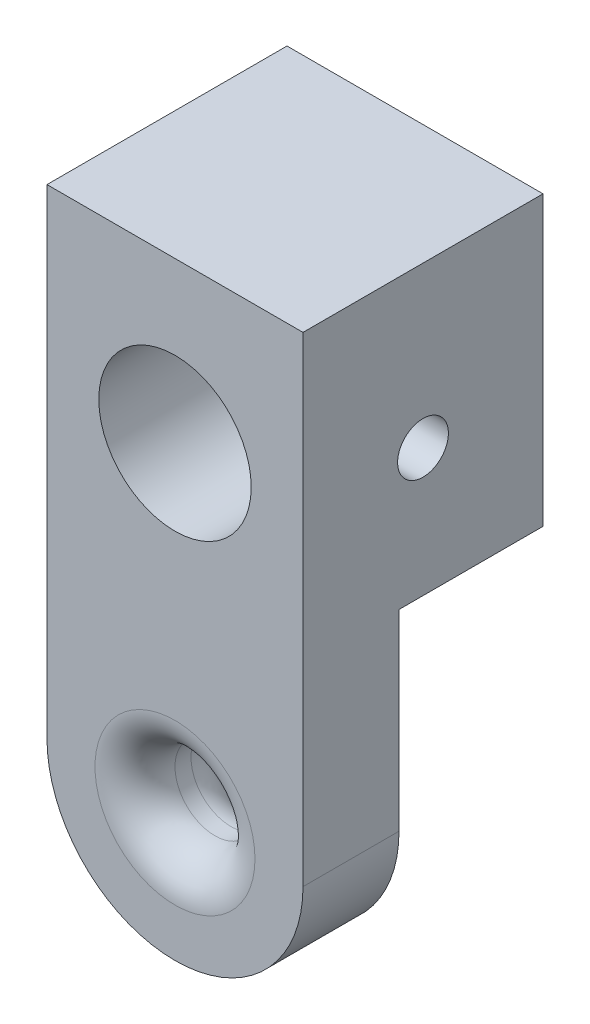
ISO-10303-21;
HEADER;
FILE_DESCRIPTION(('STEP AP214'),'2;1');
FILE_NAME('part.step','',(''),(''),'','','');
FILE_SCHEMA(('AUTOMOTIVE_DESIGN { 1 0 10303 214 1 1 1 1 }'));
ENDSEC;
DATA;
#1=APPLICATION_CONTEXT('core data for automotive mechanical design processes');
#2=APPLICATION_PROTOCOL_DEFINITION('international standard','automotive_design',2000,#1);
#3=PRODUCT_CONTEXT('',#1,'mechanical');
#4=PRODUCT('Part','Part','',(#3));
#5=PRODUCT_RELATED_PRODUCT_CATEGORY('part','',(#4));
#6=PRODUCT_DEFINITION_FORMATION('','',#4);
#7=PRODUCT_DEFINITION_CONTEXT('part definition',#1,'design');
#8=PRODUCT_DEFINITION('design','',#6,#7);
#9=PRODUCT_DEFINITION_SHAPE('','',#8);
#10=(LENGTH_UNIT() NAMED_UNIT(*) SI_UNIT(.MILLI.,.METRE.));
#11=(NAMED_UNIT(*) PLANE_ANGLE_UNIT() SI_UNIT($,.RADIAN.));
#12=(NAMED_UNIT(*) SI_UNIT($,.STERADIAN.) SOLID_ANGLE_UNIT());
#13=UNCERTAINTY_MEASURE_WITH_UNIT(LENGTH_MEASURE(1.E-05),#10,'distance_accuracy_value','');
#14=(GEOMETRIC_REPRESENTATION_CONTEXT(3) GLOBAL_UNCERTAINTY_ASSIGNED_CONTEXT((#13)) GLOBAL_UNIT_ASSIGNED_CONTEXT((#10,
#11,#12)) REPRESENTATION_CONTEXT('',''));
#15=CARTESIAN_POINT('',(0.,0.,0.));
#16=DIRECTION('',(0.,0.,1.));
#17=DIRECTION('',(1.,0.,0.));
#18=AXIS2_PLACEMENT_3D('',#15,#16,#17);
#19=CARTESIAN_POINT('',(0.,0.,0.));
#20=DIRECTION('',(0.,0.,1.));
#21=DIRECTION('',(1.,0.,0.));
#22=AXIS2_PLACEMENT_3D('',#19,#20,#21);
#23=PLANE('',#22);
#24=CARTESIAN_POINT('',(0.,20.,0.));
#25=DIRECTION('',(0.,0.,1.));
#26=DIRECTION('',(1.,0.,0.));
#27=AXIS2_PLACEMENT_3D('',#24,#25,#26);
#28=CIRCLE('',#27,4.7625);
#29=CARTESIAN_POINT('',(4.7625,20.,0.));
#30=VERTEX_POINT('',#29);
#31=EDGE_CURVE('E121',#30,#30,#28,.T.);
#32=ORIENTED_EDGE('',*,*,#31,.T.);
#33=EDGE_LOOP('',(#32));
#34=FACE_BOUND('',#33,.T.);
#35=DIRECTION('',(-1.,0.,0.));
#36=VECTOR('',#35,1.);
#37=CARTESIAN_POINT('',(8.,12.,0.));
#38=LINE('',#37,#36);
#39=CARTESIAN_POINT('',(8.,12.,0.));
#40=VERTEX_POINT('',#39);
#41=CARTESIAN_POINT('',(-8.,12.,0.));
#42=VERTEX_POINT('',#41);
#43=EDGE_CURVE('E113',#40,#42,#38,.T.);
#44=ORIENTED_EDGE('',*,*,#43,.T.);
#45=DIRECTION('',(0.,-1.,0.));
#46=VECTOR('',#45,1.);
#47=CARTESIAN_POINT('',(-8.,12.,0.));
#48=LINE('',#47,#46);
#49=CARTESIAN_POINT('',(-8.,30.,0.));
#50=VERTEX_POINT('',#49);
#51=EDGE_CURVE('E79',#50,#42,#48,.T.);
#52=ORIENTED_EDGE('',*,*,#51,.F.);
#53=DIRECTION('',(-1.,0.,0.));
#54=VECTOR('',#53,1.);
#55=CARTESIAN_POINT('',(8.,30.,0.));
#56=LINE('',#55,#54);
#57=CARTESIAN_POINT('',(8.,30.,0.));
#58=VERTEX_POINT('',#57);
#59=EDGE_CURVE('E138',#58,#50,#56,.T.);
#60=ORIENTED_EDGE('',*,*,#59,.F.);
#61=DIRECTION('',(0.,1.,0.));
#62=VECTOR('',#61,1.);
#63=CARTESIAN_POINT('',(8.,12.,0.));
#64=LINE('',#63,#62);
#65=EDGE_CURVE('E129',#40,#58,#64,.T.);
#66=ORIENTED_EDGE('',*,*,#65,.F.);
#67=EDGE_LOOP('',(#44,#52,#60,#66));
#68=FACE_BOUND('',#67,.T.);
#69=ADVANCED_FACE('F32',(#34,#68),#23,.F.);
#70=CARTESIAN_POINT('',(0.,0.,15.));
#71=DIRECTION('',(0.,0.,-1.));
#72=DIRECTION('',(-1.,0.,0.));
#73=AXIS2_PLACEMENT_3D('',#70,#71,#72);
#74=CYLINDRICAL_SURFACE('',#73,8.);
#75=CARTESIAN_POINT('',(0.,0.,9.));
#76=DIRECTION('',(0.,0.,-1.));
#77=DIRECTION('',(-1.,0.,0.));
#78=AXIS2_PLACEMENT_3D('',#75,#76,#77);
#79=CIRCLE('',#78,8.);
#80=CARTESIAN_POINT('',(8.,0.,9.));
#81=VERTEX_POINT('',#80);
#82=CARTESIAN_POINT('',(-8.,0.,9.));
#83=VERTEX_POINT('',#82);
#84=EDGE_CURVE('E54',#81,#83,#79,.T.);
#85=ORIENTED_EDGE('',*,*,#84,.F.);
#86=DIRECTION('',(0.,0.,-1.));
#87=VECTOR('',#86,1.);
#88=CARTESIAN_POINT('',(8.,0.,15.));
#89=LINE('',#88,#87);
#90=CARTESIAN_POINT('',(8.,0.,15.));
#91=VERTEX_POINT('',#90);
#92=EDGE_CURVE('E119',#91,#81,#89,.T.);
#93=ORIENTED_EDGE('',*,*,#92,.F.);
#94=CARTESIAN_POINT('',(0.,0.,15.));
#95=DIRECTION('',(0.,0.,1.));
#96=DIRECTION('',(1.,0.,0.));
#97=AXIS2_PLACEMENT_3D('',#94,#95,#96);
#98=CIRCLE('',#97,8.);
#99=CARTESIAN_POINT('',(-8.,0.,15.));
#100=VERTEX_POINT('',#99);
#101=EDGE_CURVE('E130',#100,#91,#98,.T.);
#102=ORIENTED_EDGE('',*,*,#101,.F.);
#103=DIRECTION('',(0.,0.,-1.));
#104=VECTOR('',#103,1.);
#105=CARTESIAN_POINT('',(-8.,0.,15.));
#106=LINE('',#105,#104);
#107=EDGE_CURVE('E136',#100,#83,#106,.T.);
#108=ORIENTED_EDGE('',*,*,#107,.T.);
#109=EDGE_LOOP('',(#85,#93,#102,#108));
#110=FACE_BOUND('',#109,.T.);
#111=ADVANCED_FACE('F179',(#110),#74,.T.);
#112=CARTESIAN_POINT('',(8.,12.,15.));
#113=DIRECTION('',(-1.,0.,0.));
#114=DIRECTION('',(0.,-1.,0.));
#115=AXIS2_PLACEMENT_3D('',#112,#113,#114);
#116=PLANE('',#115);
#117=CARTESIAN_POINT('',(8.00000000000001,20.,7.5));
#118=DIRECTION('',(-1.,0.,0.));
#119=DIRECTION('',(0.,0.,1.));
#120=AXIS2_PLACEMENT_3D('',#117,#118,#119);
#121=CIRCLE('',#120,1.5875);
#122=CARTESIAN_POINT('',(8.00000000000001,20.,9.0875));
#123=VERTEX_POINT('',#122);
#124=EDGE_CURVE('E162',#123,#123,#121,.T.);
#125=ORIENTED_EDGE('',*,*,#124,.T.);
#126=EDGE_LOOP('',(#125));
#127=FACE_BOUND('',#126,.T.);
#128=DIRECTION('',(0.,0.,-1.));
#129=VECTOR('',#128,1.);
#130=CARTESIAN_POINT('',(8.,12.,9.));
#131=LINE('',#130,#129);
#132=CARTESIAN_POINT('',(8.,12.,9.));
#133=VERTEX_POINT('',#132);
#134=EDGE_CURVE('E111',#133,#40,#131,.T.);
#135=ORIENTED_EDGE('',*,*,#134,.T.);
#136=ORIENTED_EDGE('',*,*,#65,.T.);
#137=DIRECTION('',(0.,0.,-1.));
#138=VECTOR('',#137,1.);
#139=CARTESIAN_POINT('',(8.,30.,15.));
#140=LINE('',#139,#138);
#141=CARTESIAN_POINT('',(8.,30.,15.));
#142=VERTEX_POINT('',#141);
#143=EDGE_CURVE('E146',#142,#58,#140,.T.);
#144=ORIENTED_EDGE('',*,*,#143,.F.);
#145=DIRECTION('',(0.,1.,0.));
#146=VECTOR('',#145,1.);
#147=CARTESIAN_POINT('',(8.,12.,15.));
#148=LINE('',#147,#146);
#149=EDGE_CURVE('E87',#91,#142,#148,.T.);
#150=ORIENTED_EDGE('',*,*,#149,.F.);
#151=ORIENTED_EDGE('',*,*,#92,.T.);
#152=DIRECTION('',(0.,1.,0.));
#153=VECTOR('',#152,1.);
#154=CARTESIAN_POINT('',(8.,12.,9.));
#155=LINE('',#154,#153);
#156=EDGE_CURVE('E105',#81,#133,#155,.T.);
#157=ORIENTED_EDGE('',*,*,#156,.T.);
#158=EDGE_LOOP('',(#135,#136,#144,#150,#151,#157));
#159=FACE_BOUND('',#158,.T.);
#160=ADVANCED_FACE('F117',(#127,#159),#116,.F.);
#161=CARTESIAN_POINT('',(-8.,12.,15.));
#162=DIRECTION('',(1.,0.,0.));
#163=DIRECTION('',(0.,1.,0.));
#164=AXIS2_PLACEMENT_3D('',#161,#162,#163);
#165=PLANE('',#164);
#166=CARTESIAN_POINT('',(-7.99999999999999,20.,7.5));
#167=DIRECTION('',(-1.,0.,0.));
#168=DIRECTION('',(0.,0.,1.));
#169=AXIS2_PLACEMENT_3D('',#166,#167,#168);
#170=CIRCLE('',#169,1.5875);
#171=CARTESIAN_POINT('',(-7.99999999999999,20.,9.0875));
#172=VERTEX_POINT('',#171);
#173=EDGE_CURVE('E320',#172,#172,#170,.T.);
#174=ORIENTED_EDGE('',*,*,#173,.F.);
#175=EDGE_LOOP('',(#174));
#176=FACE_BOUND('',#175,.T.);
#177=DIRECTION('',(0.,0.,-1.));
#178=VECTOR('',#177,1.);
#179=CARTESIAN_POINT('',(-8.,12.,9.));
#180=LINE('',#179,#178);
#181=CARTESIAN_POINT('',(-8.,12.,9.));
#182=VERTEX_POINT('',#181);
#183=EDGE_CURVE('E115',#182,#42,#180,.T.);
#184=ORIENTED_EDGE('',*,*,#183,.F.);
#185=DIRECTION('',(0.,-1.,0.));
#186=VECTOR('',#185,1.);
#187=CARTESIAN_POINT('',(-8.,12.,9.));
#188=LINE('',#187,#186);
#189=EDGE_CURVE('E106',#182,#83,#188,.T.);
#190=ORIENTED_EDGE('',*,*,#189,.T.);
#191=ORIENTED_EDGE('',*,*,#107,.F.);
#192=DIRECTION('',(0.,-1.,0.));
#193=VECTOR('',#192,1.);
#194=CARTESIAN_POINT('',(-8.,30.,15.));
#195=LINE('',#194,#193);
#196=CARTESIAN_POINT('',(-8.,30.,15.));
#197=VERTEX_POINT('',#196);
#198=EDGE_CURVE('E63',#197,#100,#195,.T.);
#199=ORIENTED_EDGE('',*,*,#198,.F.);
#200=DIRECTION('',(0.,0.,-1.));
#201=VECTOR('',#200,1.);
#202=CARTESIAN_POINT('',(-8.,30.,15.));
#203=LINE('',#202,#201);
#204=EDGE_CURVE('E143',#197,#50,#203,.T.);
#205=ORIENTED_EDGE('',*,*,#204,.T.);
#206=ORIENTED_EDGE('',*,*,#51,.T.);
#207=EDGE_LOOP('',(#184,#190,#191,#199,#205,#206));
#208=FACE_BOUND('',#207,.T.);
#209=ADVANCED_FACE('F192',(#176,#208),#165,.F.);
#210=CARTESIAN_POINT('',(0.,0.,15.));
#211=DIRECTION('',(0.,0.,-1.));
#212=DIRECTION('',(-1.,0.,0.));
#213=AXIS2_PLACEMENT_3D('',#210,#211,#212);
#214=CYLINDRICAL_SURFACE('',#213,2.5);
#215=CARTESIAN_POINT('',(0.,0.,12.5));
#216=DIRECTION('',(0.,0.,1.));
#217=DIRECTION('',(1.,0.,0.));
#218=AXIS2_PLACEMENT_3D('',#215,#216,#217);
#219=CIRCLE('',#218,2.5);
#220=CARTESIAN_POINT('',(2.5,0.,12.5));
#221=VERTEX_POINT('',#220);
#222=EDGE_CURVE('E153',#221,#221,#219,.T.);
#223=ORIENTED_EDGE('',*,*,#222,.T.);
#224=EDGE_LOOP('',(#223));
#225=FACE_BOUND('',#224,.T.);
#226=CARTESIAN_POINT('',(0.,0.,11.5));
#227=DIRECTION('',(0.,0.,-1.));
#228=DIRECTION('',(-1.,0.,0.));
#229=AXIS2_PLACEMENT_3D('',#226,#227,#228);
#230=CIRCLE('',#229,2.5);
#231=CARTESIAN_POINT('',(-2.5,0.,11.5));
#232=VERTEX_POINT('',#231);
#233=EDGE_CURVE('E150',#232,#232,#230,.T.);
#234=ORIENTED_EDGE('',*,*,#233,.T.);
#235=EDGE_LOOP('',(#234));
#236=FACE_BOUND('',#235,.T.);
#237=ADVANCED_FACE('F195',(#225,#236),#214,.F.);
#238=CARTESIAN_POINT('',(0.,0.,15.));
#239=DIRECTION('',(0.,0.,1.));
#240=DIRECTION('',(1.,0.,0.));
#241=AXIS2_PLACEMENT_3D('',#238,#239,#240);
#242=PLANE('',#241);
#243=CARTESIAN_POINT('',(0.,20.,15.));
#244=DIRECTION('',(0.,0.,1.));
#245=DIRECTION('',(1.,0.,0.));
#246=AXIS2_PLACEMENT_3D('',#243,#244,#245);
#247=CIRCLE('',#246,4.76249999999999);
#248=CARTESIAN_POINT('',(4.76249999999999,20.,15.));
#249=VERTEX_POINT('',#248);
#250=EDGE_CURVE('E316',#249,#249,#247,.T.);
#251=ORIENTED_EDGE('',*,*,#250,.F.);
#252=EDGE_LOOP('',(#251));
#253=FACE_BOUND('',#252,.T.);
#254=CARTESIAN_POINT('',(0.,0.,15.));
#255=DIRECTION('',(0.,0.,1.));
#256=DIRECTION('',(1.,0.,0.));
#257=AXIS2_PLACEMENT_3D('',#254,#255,#256);
#258=CIRCLE('',#257,5.);
#259=CARTESIAN_POINT('',(5.,0.,15.));
#260=VERTEX_POINT('',#259);
#261=EDGE_CURVE('E46',#260,#260,#258,.F.);
#262=ORIENTED_EDGE('',*,*,#261,.T.);
#263=EDGE_LOOP('',(#262));
#264=FACE_BOUND('',#263,.T.);
#265=ORIENTED_EDGE('',*,*,#101,.T.);
#266=ORIENTED_EDGE('',*,*,#149,.T.);
#267=DIRECTION('',(-1.,0.,0.));
#268=VECTOR('',#267,1.);
#269=CARTESIAN_POINT('',(8.,30.,15.));
#270=LINE('',#269,#268);
#271=EDGE_CURVE('E133',#142,#197,#270,.T.);
#272=ORIENTED_EDGE('',*,*,#271,.T.);
#273=ORIENTED_EDGE('',*,*,#198,.T.);
#274=EDGE_LOOP('',(#265,#266,#272,#273));
#275=FACE_BOUND('',#274,.T.);
#276=ADVANCED_FACE('F190',(#253,#264,#275),#242,.T.);
#277=CARTESIAN_POINT('',(8.,30.,15.));
#278=DIRECTION('',(0.,-1.,0.));
#279=DIRECTION('',(1.,0.,0.));
#280=AXIS2_PLACEMENT_3D('',#277,#278,#279);
#281=PLANE('',#280);
#282=ORIENTED_EDGE('',*,*,#59,.T.);
#283=ORIENTED_EDGE('',*,*,#204,.F.);
#284=ORIENTED_EDGE('',*,*,#271,.F.);
#285=ORIENTED_EDGE('',*,*,#143,.T.);
#286=EDGE_LOOP('',(#282,#283,#284,#285));
#287=FACE_BOUND('',#286,.T.);
#288=ADVANCED_FACE('F197',(#287),#281,.F.);
#289=CARTESIAN_POINT('',(0.,0.,9.));
#290=DIRECTION('',(0.,0.,-1.));
#291=DIRECTION('',(-1.,0.,0.));
#292=AXIS2_PLACEMENT_3D('',#289,#290,#291);
#293=PLANE('',#292);
#294=CARTESIAN_POINT('',(0.,0.,9.));
#295=DIRECTION('',(0.,0.,-1.));
#296=DIRECTION('',(-1.,0.,0.));
#297=AXIS2_PLACEMENT_3D('',#294,#295,#296);
#298=CIRCLE('',#297,5.);
#299=CARTESIAN_POINT('',(-5.,0.,9.));
#300=VERTEX_POINT('',#299);
#301=EDGE_CURVE('E11',#300,#300,#298,.F.);
#302=ORIENTED_EDGE('',*,*,#301,.T.);
#303=EDGE_LOOP('',(#302));
#304=FACE_BOUND('',#303,.T.);
#305=ORIENTED_EDGE('',*,*,#84,.T.);
#306=ORIENTED_EDGE('',*,*,#189,.F.);
#307=DIRECTION('',(-1.,0.,0.));
#308=VECTOR('',#307,1.);
#309=CARTESIAN_POINT('',(8.,12.,9.));
#310=LINE('',#309,#308);
#311=EDGE_CURVE('E101',#133,#182,#310,.T.);
#312=ORIENTED_EDGE('',*,*,#311,.F.);
#313=ORIENTED_EDGE('',*,*,#156,.F.);
#314=EDGE_LOOP('',(#305,#306,#312,#313));
#315=FACE_BOUND('',#314,.T.);
#316=ADVANCED_FACE('F103',(#304,#315),#293,.T.);
#317=CARTESIAN_POINT('',(8.,12.,9.));
#318=DIRECTION('',(0.,-1.,0.));
#319=DIRECTION('',(1.,0.,0.));
#320=AXIS2_PLACEMENT_3D('',#317,#318,#319);
#321=PLANE('',#320);
#322=ORIENTED_EDGE('',*,*,#43,.F.);
#323=ORIENTED_EDGE('',*,*,#134,.F.);
#324=ORIENTED_EDGE('',*,*,#311,.T.);
#325=ORIENTED_EDGE('',*,*,#183,.T.);
#326=EDGE_LOOP('',(#322,#323,#324,#325));
#327=FACE_BOUND('',#326,.T.);
#328=ADVANCED_FACE('F112',(#327),#321,.T.);
#329=CARTESIAN_POINT('',(0.,0.,12.5));
#330=DIRECTION('',(0.,0.,1.));
#331=DIRECTION('',(1.,0.,0.));
#332=AXIS2_PLACEMENT_3D('',#329,#330,#331);
#333=TOROIDAL_SURFACE('',#332,5.,2.5);
#334=ORIENTED_EDGE('',*,*,#261,.F.);
#335=EDGE_LOOP('',(#334));
#336=FACE_BOUND('',#335,.T.);
#337=ORIENTED_EDGE('',*,*,#222,.F.);
#338=EDGE_LOOP('',(#337));
#339=FACE_BOUND('',#338,.T.);
#340=ADVANCED_FACE('F203',(#336,#339),#333,.T.);
#341=CARTESIAN_POINT('',(0.,0.,11.5));
#342=DIRECTION('',(0.,0.,-1.));
#343=DIRECTION('',(-1.,0.,0.));
#344=AXIS2_PLACEMENT_3D('',#341,#342,#343);
#345=TOROIDAL_SURFACE('',#344,5.,2.5);
#346=ORIENTED_EDGE('',*,*,#301,.F.);
#347=EDGE_LOOP('',(#346));
#348=FACE_BOUND('',#347,.T.);
#349=ORIENTED_EDGE('',*,*,#233,.F.);
#350=EDGE_LOOP('',(#349));
#351=FACE_BOUND('',#350,.T.);
#352=ADVANCED_FACE('F34',(#348,#351),#345,.T.);
#353=CARTESIAN_POINT('',(0.,20.,15.));
#354=DIRECTION('',(0.,0.,1.));
#355=DIRECTION('',(1.,0.,0.));
#356=AXIS2_PLACEMENT_3D('',#353,#354,#355);
#357=CYLINDRICAL_SURFACE('',#356,4.76249999999999);
#358=CARTESIAN_POINT('',(4.76249999999999,20.,5.9125));
#359=CARTESIAN_POINT('',(4.76250024290248,20.0866193385827,5.91249959720103));
#360=CARTESIAN_POINT('',(4.76011509093227,20.1732362463299,5.91961242247696));
#361=CARTESIAN_POINT('',(4.75083521197707,20.3439187953858,5.94778871024734));
#362=CARTESIAN_POINT('',(4.74394001683416,20.4279841708886,5.96885362101892));
#363=CARTESIAN_POINT('',(4.72638926301477,20.5910783033341,6.02413179887218));
#364=CARTESIAN_POINT('',(4.71573999272729,20.6701152235941,6.0583230866541));
#365=CARTESIAN_POINT('',(4.69176807576279,20.8213327121784,6.13878411188088));
#366=CARTESIAN_POINT('',(4.67844490185097,20.8935119241719,6.18505623194163));
#367=CARTESIAN_POINT('',(4.6500112492827,21.0314649090978,6.29004846521327));
#368=CARTESIAN_POINT('',(4.63485795886258,21.0969683742236,6.34911208438853));
#369=CARTESIAN_POINT('',(4.60470749718205,21.2173468996646,6.47728035809667));
#370=CARTESIAN_POINT('',(4.58971036098746,21.2722196194645,6.54638721794901));
#371=CARTESIAN_POINT('',(4.56109915307671,21.3713220957867,6.69511387037438));
#372=CARTESIAN_POINT('',(4.54753724850154,21.4152004624259,6.77497881182475));
#373=CARTESIAN_POINT('',(4.52398297352029,21.4887874622809,6.94147954995294));
#374=CARTESIAN_POINT('',(4.51398951405183,21.5185004196015,7.02811327099586));
#375=CARTESIAN_POINT('',(4.49915443940136,21.5618991201458,7.20261873912603));
#376=CARTESIAN_POINT('',(4.49415052034257,21.5760913491314,7.29035031847639));
#377=CARTESIAN_POINT('',(4.48938104899342,21.5896290332935,7.46708120972246));
#378=CARTESIAN_POINT('',(4.48961387798583,21.5889790762975,7.55608012137584));
#379=CARTESIAN_POINT('',(4.49514936325485,21.5732440971292,7.72849940082988));
#380=CARTESIAN_POINT('',(4.50021985189708,21.5588200871526,7.81198883963394));
#381=CARTESIAN_POINT('',(4.51447944137724,21.5170247835234,7.97528705362585));
#382=CARTESIAN_POINT('',(4.5236690353227,21.4896519397146,8.05509538687817));
#383=CARTESIAN_POINT('',(4.54529683920857,21.4223032546706,8.21026773997647));
#384=CARTESIAN_POINT('',(4.55778498196573,21.3821315523228,8.28553949043287));
#385=CARTESIAN_POINT('',(4.58458186738965,21.2904614562562,8.42848256689406));
#386=CARTESIAN_POINT('',(4.5988911354236,21.2389597908779,8.49615168900674));
#387=CARTESIAN_POINT('',(4.62863135053788,21.1229170656331,8.62568291208023));
#388=CARTESIAN_POINT('',(4.64408185600812,21.0578356257461,8.68705740253315));
#389=CARTESIAN_POINT('',(4.6737101468942,20.9181140673275,8.79814838582814));
#390=CARTESIAN_POINT('',(4.68788781016681,20.8434730331115,8.84786376058613));
#391=CARTESIAN_POINT('',(4.71355908851247,20.685716835711,8.93461787662317));
#392=CARTESIAN_POINT('',(4.72502468137761,20.6025249513109,8.97152596750341));
#393=CARTESIAN_POINT('',(4.74377650341789,20.4306396698412,9.03067253865469));
#394=CARTESIAN_POINT('',(4.7510641842712,20.341948195571,9.0529161147347));
#395=CARTESIAN_POINT('',(4.76039857975911,20.1657093293778,9.08123836981049));
#396=CARTESIAN_POINT('',(4.76265877911042,20.0782789897854,9.08797594706174));
#397=CARTESIAN_POINT('',(4.76232383028038,19.9035195764381,9.08697188066243));
#398=CARTESIAN_POINT('',(4.75972950165737,19.8161904880801,9.07923268103194));
#399=CARTESIAN_POINT('',(4.75011789238402,19.646749712242,9.05001609646916));
#400=CARTESIAN_POINT('',(4.74323090454017,19.5645601691497,9.02894314789643));
#401=CARTESIAN_POINT('',(4.72585806842735,19.4049161657549,8.97416290690907));
#402=CARTESIAN_POINT('',(4.71537176124096,19.3274623107426,8.94045400334489));
#403=CARTESIAN_POINT('',(4.69152178418572,19.1772173294757,8.86037568945275));
#404=CARTESIAN_POINT('',(4.6780896842481,19.1046024397428,8.81369658316297));
#405=CARTESIAN_POINT('',(4.64987090592066,18.9680220821598,8.7093667868536));
#406=CARTESIAN_POINT('',(4.635083814552,18.9040592661245,8.65171274604957));
#407=CARTESIAN_POINT('',(4.60496996168955,18.7835741438575,8.52397123277704));
#408=CARTESIAN_POINT('',(4.58964920726291,18.7275219613223,8.45343785225361));
#409=CARTESIAN_POINT('',(4.56088707605349,18.6279911833113,8.30363763610021));
#410=CARTESIAN_POINT('',(4.54744571493928,18.5845126926595,8.2243707276684));
#411=CARTESIAN_POINT('',(4.52409546968821,18.511564872964,8.05931908822729));
#412=CARTESIAN_POINT('',(4.51417945258853,18.482067215188,7.97354794931959));
#413=CARTESIAN_POINT('',(4.49914696286488,18.4380672165195,7.79784889305495));
#414=CARTESIAN_POINT('',(4.49402832815027,18.4235581202606,7.7079228674206));
#415=CARTESIAN_POINT('',(4.48941600962756,18.4104739015672,7.53143711003505));
#416=CARTESIAN_POINT('',(4.48964685408646,18.4111184665229,7.44494178479467));
#417=CARTESIAN_POINT('',(4.49502640845389,18.4264028591502,7.27336044356123));
#418=CARTESIAN_POINT('',(4.50017482566361,18.4410418538595,7.1882743439963));
#419=CARTESIAN_POINT('',(4.51460432334015,18.4833472466572,7.02353463498358));
#420=CARTESIAN_POINT('',(4.52380505610682,18.5107609382004,6.94380854030536));
#421=CARTESIAN_POINT('',(4.54527283124318,18.5776327568564,6.7900264914855));
#422=CARTESIAN_POINT('',(4.55754055411886,18.6170935574208,6.71597180048904));
#423=CARTESIAN_POINT('',(4.58442741396348,18.7089486505238,6.57213217399738));
#424=CARTESIAN_POINT('',(4.59912579731892,18.7618321646112,6.50267455323632));
#425=CARTESIAN_POINT('',(4.62888578099663,18.8782044230222,6.37336742125259));
#426=CARTESIAN_POINT('',(4.6439474829839,18.9416961659333,6.31352063609518));
#427=CARTESIAN_POINT('',(4.673441734593,19.0804540283884,6.20278324549093));
#428=CARTESIAN_POINT('',(4.68782688609494,19.1560825973192,6.15233259794529));
#429=CARTESIAN_POINT('',(4.71370010986521,19.315220195117,6.0649151941996));
#430=CARTESIAN_POINT('',(4.72518892253838,19.3987272024649,6.02794499084876));
#431=CARTESIAN_POINT('',(4.74353755171309,19.5674163350685,5.97009190842424));
#432=CARTESIAN_POINT('',(4.75058124720754,19.6523569346887,5.94856408480689));
#433=CARTESIAN_POINT('',(4.76006171214451,19.8248663395837,5.91977030442507));
#434=CARTESIAN_POINT('',(4.76249975444398,19.9124344119096,5.91250040719925));
#435=CARTESIAN_POINT('',(4.76249999999999,20.,5.9125));
#436=B_SPLINE_CURVE_WITH_KNOTS('',3,(#358,#359,#360,#361,#362,#363,#364,#365,#366,#367,#368,
#369,#370,#371,#372,#373,#374,#375,#376,#377,#378,#379,#380,#381,#382,#383,#384,#385,#386,#387,
#388,#389,#390,#391,#392,#393,#394,#395,#396,#397,#398,#399,#400,#401,#402,#403,#404,#405,#406,
#407,#408,#409,#410,#411,#412,#413,#414,#415,#416,#417,#418,#419,#420,#421,#422,#423,#424,#425,
#426,#427,#428,#429,#430,#431,#432,#433,#434,#435),.UNSPECIFIED.,.T.,.F.,(4,2,2,2,2,2,2,2,2,2,2,
2,2,2,2,2,2,2,2,2,2,2,2,2,2,2,2,2,2,2,2,2,2,2,2,2,2,2,4),(0.,0.259535780816293,
0.519098506612187,0.778228493181554,1.03740962475607,1.30468186298874,1.57201287843954,
1.84703060907259,2.12196433449872,2.38763057115171,2.65321468955132,2.90666212150157,
3.16013990233077,3.41769971708769,3.67533400311153,3.94641872975545,4.21752944222006,
4.49132968969941,4.76503474342567,5.02687563290581,5.28867232148129,5.54288575790413,
5.79713161888513,6.0580650975193,6.31907837054751,6.59195123823192,6.86482638073056,
7.13714621949996,7.40934326970519,7.66755619877008,7.92575375970307,8.17904744490161,
8.43239738104363,8.69680230873238,8.96128210158997,9.2360696157572,9.51078681329522,
9.77323036418427,10.0356013733555),.UNSPECIFIED.);
#437=CARTESIAN_POINT('',(4.76249999999999,20.,5.9125));
#438=VERTEX_POINT('',#437);
#439=EDGE_CURVE('E36',#438,#438,#436,.T.);
#440=ORIENTED_EDGE('',*,*,#439,.T.);
#441=EDGE_LOOP('',(#440));
#442=FACE_BOUND('',#441,.T.);
#443=CARTESIAN_POINT('',(-4.76249999999999,20.,9.0875));
#444=CARTESIAN_POINT('',(-4.76250024290248,20.0866193385827,9.08750040279898));
#445=CARTESIAN_POINT('',(-4.76011509093226,20.1732362463299,9.08038757752304));
#446=CARTESIAN_POINT('',(-4.75083521197707,20.3439187953858,9.05221128975266));
#447=CARTESIAN_POINT('',(-4.74394001683416,20.4279841708886,9.03114637898108));
#448=CARTESIAN_POINT('',(-4.72638926301477,20.5910783033341,8.97586820112782));
#449=CARTESIAN_POINT('',(-4.71573999272729,20.6701152235941,8.9416769133459));
#450=CARTESIAN_POINT('',(-4.69176807576279,20.8213327121784,8.86121588811912));
#451=CARTESIAN_POINT('',(-4.67844490185097,20.8935119241719,8.81494376805837));
#452=CARTESIAN_POINT('',(-4.6500112492827,21.0314649090978,8.70995153478673));
#453=CARTESIAN_POINT('',(-4.63485795886257,21.0969683742236,8.65088791561147));
#454=CARTESIAN_POINT('',(-4.60470749718204,21.2173468996646,8.52271964190333));
#455=CARTESIAN_POINT('',(-4.58971036098746,21.2722196194645,8.45361278205099));
#456=CARTESIAN_POINT('',(-4.56109915307671,21.3713220957867,8.30488612962562));
#457=CARTESIAN_POINT('',(-4.54753724850154,21.4152004624259,8.22502118817526));
#458=CARTESIAN_POINT('',(-4.52398297352029,21.4887874622809,8.05852045004706));
#459=CARTESIAN_POINT('',(-4.51398951405183,21.5185004196015,7.97188672900415));
#460=CARTESIAN_POINT('',(-4.49915443940136,21.5618991201458,7.79738126087397));
#461=CARTESIAN_POINT('',(-4.49415052034257,21.5760913491314,7.70964968152361));
#462=CARTESIAN_POINT('',(-4.48938104899342,21.5896290332935,7.53291879027754));
#463=CARTESIAN_POINT('',(-4.48961387798583,21.5889790762975,7.44391987862416));
#464=CARTESIAN_POINT('',(-4.49514936325485,21.5732440971292,7.27150059917012));
#465=CARTESIAN_POINT('',(-4.50021985189708,21.5588200871526,7.18801116036606));
#466=CARTESIAN_POINT('',(-4.51447944137724,21.5170247835234,7.02471294637415));
#467=CARTESIAN_POINT('',(-4.5236690353227,21.4896519397146,6.94490461312183));
#468=CARTESIAN_POINT('',(-4.54529683920857,21.4223032546706,6.78973226002353));
#469=CARTESIAN_POINT('',(-4.55778498196573,21.3821315523228,6.71446050956713));
#470=CARTESIAN_POINT('',(-4.58458186738965,21.2904614562562,6.57151743310594));
#471=CARTESIAN_POINT('',(-4.5988911354236,21.2389597908779,6.50384831099326));
#472=CARTESIAN_POINT('',(-4.62863135053788,21.1229170656331,6.37431708791978));
#473=CARTESIAN_POINT('',(-4.64408185600812,21.0578356257461,6.31294259746686));
#474=CARTESIAN_POINT('',(-4.6737101468942,20.9181140673275,6.20185161417186));
#475=CARTESIAN_POINT('',(-4.68788781016681,20.8434730331115,6.15213623941387));
#476=CARTESIAN_POINT('',(-4.71355908851246,20.6857168357109,6.06538212337683));
#477=CARTESIAN_POINT('',(-4.72502468137761,20.6025249513109,6.02847403249659));
#478=CARTESIAN_POINT('',(-4.74377650341789,20.4306396698412,5.96932746134531));
#479=CARTESIAN_POINT('',(-4.7510641842712,20.341948195571,5.9470838852653));
#480=CARTESIAN_POINT('',(-4.76039857975911,20.1657093293778,5.91876163018951));
#481=CARTESIAN_POINT('',(-4.76265877911042,20.0782789897854,5.91202405293826));
#482=CARTESIAN_POINT('',(-4.76232383028038,19.9035195764381,5.91302811933757));
#483=CARTESIAN_POINT('',(-4.75972950165737,19.8161904880801,5.92076731896806));
#484=CARTESIAN_POINT('',(-4.75011789238402,19.646749712242,5.94998390353084));
#485=CARTESIAN_POINT('',(-4.74323090454017,19.5645601691497,5.97105685210357));
#486=CARTESIAN_POINT('',(-4.72585806842735,19.4049161657549,6.02583709309093));
#487=CARTESIAN_POINT('',(-4.71537176124096,19.3274623107426,6.05954599665511));
#488=CARTESIAN_POINT('',(-4.69152178418572,19.1772173294757,6.13962431054725));
#489=CARTESIAN_POINT('',(-4.6780896842481,19.1046024397428,6.18630341683703));
#490=CARTESIAN_POINT('',(-4.64987090592066,18.9680220821598,6.29063321314641));
#491=CARTESIAN_POINT('',(-4.635083814552,18.9040592661245,6.34828725395043));
#492=CARTESIAN_POINT('',(-4.60496996168955,18.7835741438575,6.47602876722296));
#493=CARTESIAN_POINT('',(-4.58964920726291,18.7275219613223,6.54656214774639));
#494=CARTESIAN_POINT('',(-4.56088707605349,18.6279911833113,6.69636236389979));
#495=CARTESIAN_POINT('',(-4.54744571493928,18.5845126926595,6.7756292723316));
#496=CARTESIAN_POINT('',(-4.5240954696882,18.511564872964,6.94068091177271));
#497=CARTESIAN_POINT('',(-4.51417945258853,18.482067215188,7.02645205068042));
#498=CARTESIAN_POINT('',(-4.49914696286488,18.4380672165195,7.20215110694506));
#499=CARTESIAN_POINT('',(-4.49402832815027,18.4235581202606,7.2920771325794));
#500=CARTESIAN_POINT('',(-4.48941600962755,18.4104739015672,7.46856288996495));
#501=CARTESIAN_POINT('',(-4.48964685408646,18.4111184665229,7.55505821520533));
#502=CARTESIAN_POINT('',(-4.49502640845389,18.4264028591502,7.72663955643877));
#503=CARTESIAN_POINT('',(-4.50017482566361,18.4410418538595,7.8117256560037));
#504=CARTESIAN_POINT('',(-4.51460432334015,18.4833472466572,7.97646536501643));
#505=CARTESIAN_POINT('',(-4.52380505610682,18.5107609382004,8.05619145969464));
#506=CARTESIAN_POINT('',(-4.54527283124318,18.5776327568564,8.2099735085145));
#507=CARTESIAN_POINT('',(-4.55754055411886,18.6170935574208,8.28402819951096));
#508=CARTESIAN_POINT('',(-4.58442741396347,18.7089486505238,8.42786782600262));
#509=CARTESIAN_POINT('',(-4.59912579731892,18.7618321646112,8.49732544676369));
#510=CARTESIAN_POINT('',(-4.62888578099663,18.8782044230222,8.62663257874742));
#511=CARTESIAN_POINT('',(-4.6439474829839,18.9416961659333,8.68647936390482));
#512=CARTESIAN_POINT('',(-4.673441734593,19.0804540283884,8.79721675450907));
#513=CARTESIAN_POINT('',(-4.68782688609494,19.1560825973192,8.84766740205471));
#514=CARTESIAN_POINT('',(-4.71370010986521,19.315220195117,8.9350848058004));
#515=CARTESIAN_POINT('',(-4.72518892253838,19.3987272024649,8.97205500915124));
#516=CARTESIAN_POINT('',(-4.74353755171309,19.5674163350685,9.02990809157576));
#517=CARTESIAN_POINT('',(-4.75058124720754,19.6523569346887,9.05143591519311));
#518=CARTESIAN_POINT('',(-4.76006171214451,19.8248663395837,9.08022969557494));
#519=CARTESIAN_POINT('',(-4.76249975444398,19.9124344119096,9.08749959280075));
#520=CARTESIAN_POINT('',(-4.76249999999999,20.,9.0875));
#521=B_SPLINE_CURVE_WITH_KNOTS('',3,(#443,#444,#445,#446,#447,#448,#449,#450,#451,#452,#453,
#454,#455,#456,#457,#458,#459,#460,#461,#462,#463,#464,#465,#466,#467,#468,#469,#470,#471,#472,
#473,#474,#475,#476,#477,#478,#479,#480,#481,#482,#483,#484,#485,#486,#487,#488,#489,#490,#491,
#492,#493,#494,#495,#496,#497,#498,#499,#500,#501,#502,#503,#504,#505,#506,#507,#508,#509,#510,
#511,#512,#513,#514,#515,#516,#517,#518,#519,#520),.UNSPECIFIED.,.T.,.F.,(4,2,2,2,2,2,2,2,2,2,2,
2,2,2,2,2,2,2,2,2,2,2,2,2,2,2,2,2,2,2,2,2,2,2,2,2,2,2,4),(0.,0.259535780816293,
0.519098506612188,0.778228493181554,1.03740962475607,1.30468186298875,1.57201287843954,
1.84703060907259,2.12196433449872,2.3876305711517,2.65321468955133,2.90666212150157,
3.16013990233077,3.41769971708769,3.67533400311153,3.94641872975544,4.21752944222006,
4.49132968969942,4.76503474342567,5.02687563290581,5.28867232148129,5.54288575790412,
5.79713161888513,6.0580650975193,6.31907837054751,6.59195123823192,6.86482638073056,
7.13714621949996,7.40934326970519,7.66755619877008,7.92575375970307,8.17904744490161,
8.43239738104363,8.69680230873238,8.96128210158997,9.2360696157572,9.51078681329523,
9.77323036418427,10.0356013733554),.UNSPECIFIED.);
#522=CARTESIAN_POINT('',(-4.76249999999999,20.,9.0875));
#523=VERTEX_POINT('',#522);
#524=EDGE_CURVE('E157',#523,#523,#521,.T.);
#525=ORIENTED_EDGE('',*,*,#524,.T.);
#526=EDGE_LOOP('',(#525));
#527=FACE_BOUND('',#526,.T.);
#528=ORIENTED_EDGE('',*,*,#31,.F.);
#529=EDGE_LOOP('',(#528));
#530=FACE_BOUND('',#529,.T.);
#531=ORIENTED_EDGE('',*,*,#250,.T.);
#532=EDGE_LOOP('',(#531));
#533=FACE_BOUND('',#532,.T.);
#534=ADVANCED_FACE('F163',(#442,#527,#530,#533),#357,.F.);
#535=CARTESIAN_POINT('',(-7.99999999999999,20.,7.5));
#536=DIRECTION('',(-1.,0.,0.));
#537=DIRECTION('',(0.,0.,1.));
#538=AXIS2_PLACEMENT_3D('',#535,#536,#537);
#539=CYLINDRICAL_SURFACE('',#538,1.5875);
#540=ORIENTED_EDGE('',*,*,#173,.T.);
#541=EDGE_LOOP('',(#540));
#542=FACE_BOUND('',#541,.T.);
#543=ORIENTED_EDGE('',*,*,#524,.F.);
#544=EDGE_LOOP('',(#543));
#545=FACE_BOUND('',#544,.T.);
#546=ADVANCED_FACE('F169',(#542,#545),#539,.F.);
#547=ORIENTED_EDGE('',*,*,#124,.F.);
#548=EDGE_LOOP('',(#547));
#549=FACE_BOUND('',#548,.T.);
#550=ORIENTED_EDGE('',*,*,#439,.F.);
#551=EDGE_LOOP('',(#550));
#552=FACE_BOUND('',#551,.T.);
#553=ADVANCED_FACE('F166',(#549,#552),#539,.F.);
#554=CLOSED_SHELL('',(#69,#111,#160,#209,#237,#276,#288,#316,#328,#340,#352,#534,#546,#553));
#555=MANIFOLD_SOLID_BREP('B2',#554);
#556=ADVANCED_BREP_SHAPE_REPRESENTATION('',(#18,#555),#14);
#557=SHAPE_DEFINITION_REPRESENTATION(#9,#556);
ENDSEC;
END-ISO-10303-21;
